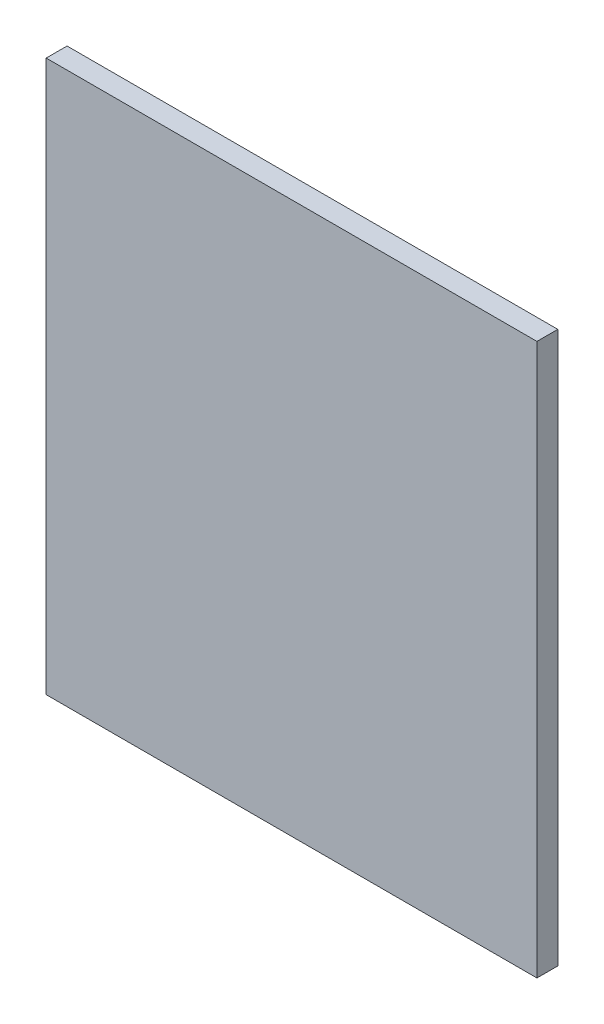
ISO-10303-21;
HEADER;
FILE_DESCRIPTION(('STEP AP214'),'2;1');
FILE_NAME('part.step','',(''),(''),'','','');
FILE_SCHEMA(('AUTOMOTIVE_DESIGN { 1 0 10303 214 1 1 1 1 }'));
ENDSEC;
DATA;
#1=APPLICATION_CONTEXT('core data for automotive mechanical design processes');
#2=APPLICATION_PROTOCOL_DEFINITION('international standard','automotive_design',2000,#1);
#3=PRODUCT_CONTEXT('',#1,'mechanical');
#4=PRODUCT('Part','Part','',(#3));
#5=PRODUCT_RELATED_PRODUCT_CATEGORY('part','',(#4));
#6=PRODUCT_DEFINITION_FORMATION('','',#4);
#7=PRODUCT_DEFINITION_CONTEXT('part definition',#1,'design');
#8=PRODUCT_DEFINITION('design','',#6,#7);
#9=PRODUCT_DEFINITION_SHAPE('','',#8);
#10=(LENGTH_UNIT() NAMED_UNIT(*) SI_UNIT(.MILLI.,.METRE.));
#11=(NAMED_UNIT(*) PLANE_ANGLE_UNIT() SI_UNIT($,.RADIAN.));
#12=(NAMED_UNIT(*) SI_UNIT($,.STERADIAN.) SOLID_ANGLE_UNIT());
#13=UNCERTAINTY_MEASURE_WITH_UNIT(LENGTH_MEASURE(1.E-05),#10,'distance_accuracy_value','');
#14=(GEOMETRIC_REPRESENTATION_CONTEXT(3) GLOBAL_UNCERTAINTY_ASSIGNED_CONTEXT((#13)) GLOBAL_UNIT_ASSIGNED_CONTEXT((#10,
#11,#12)) REPRESENTATION_CONTEXT('',''));
#15=CARTESIAN_POINT('',(0.,0.,0.));
#16=DIRECTION('',(0.,0.,1.));
#17=DIRECTION('',(1.,0.,0.));
#18=AXIS2_PLACEMENT_3D('',#15,#16,#17);
#19=CARTESIAN_POINT('',(-1.17499892,-1.3199999,0.));
#20=DIRECTION('',(-1.,0.,0.));
#21=DIRECTION('',(0.,1.,0.));
#22=AXIS2_PLACEMENT_3D('',#19,#20,#21);
#23=PLANE('',#22);
#24=DIRECTION('',(0.,0.,1.));
#25=VECTOR('',#24,1.);
#26=CARTESIAN_POINT('',(-1.17499892,-1.3199999,0.));
#27=LINE('',#26,#25);
#28=CARTESIAN_POINT('',(-1.17499892,-1.3199999,0.));
#29=VERTEX_POINT('',#28);
#30=CARTESIAN_POINT('',(-1.17499892,-1.3199999,0.10000234));
#31=VERTEX_POINT('',#30);
#32=EDGE_CURVE('E11',#29,#31,#27,.T.);
#33=ORIENTED_EDGE('',*,*,#32,.T.);
#34=DIRECTION('',(0.,1.,0.));
#35=VECTOR('',#34,1.);
#36=CARTESIAN_POINT('',(-1.17499892,-1.3199999,0.10000234));
#37=LINE('',#36,#35);
#38=CARTESIAN_POINT('',(-1.17499892,1.3199999,0.10000234));
#39=VERTEX_POINT('',#38);
#40=EDGE_CURVE('E24',#31,#39,#37,.T.);
#41=ORIENTED_EDGE('',*,*,#40,.T.);
#42=DIRECTION('',(0.,0.,1.));
#43=VECTOR('',#42,1.);
#44=CARTESIAN_POINT('',(-1.17499892,1.3199999,0.));
#45=LINE('',#44,#43);
#46=CARTESIAN_POINT('',(-1.17499892,1.3199999,0.));
#47=VERTEX_POINT('',#46);
#48=EDGE_CURVE('E85',#47,#39,#45,.T.);
#49=ORIENTED_EDGE('',*,*,#48,.F.);
#50=DIRECTION('',(0.,1.,0.));
#51=VECTOR('',#50,1.);
#52=CARTESIAN_POINT('',(-1.17499892,-1.3199999,0.));
#53=LINE('',#52,#51);
#54=EDGE_CURVE('E83',#29,#47,#53,.T.);
#55=ORIENTED_EDGE('',*,*,#54,.F.);
#56=EDGE_LOOP('',(#33,#41,#49,#55));
#57=FACE_BOUND('',#56,.T.);
#58=ADVANCED_FACE('F17',(#57),#23,.T.);
#59=CARTESIAN_POINT('',(-1.17499892,1.3199999,0.));
#60=DIRECTION('',(0.,1.,0.));
#61=DIRECTION('',(1.,0.,0.));
#62=AXIS2_PLACEMENT_3D('',#59,#60,#61);
#63=PLANE('',#62);
#64=ORIENTED_EDGE('',*,*,#48,.T.);
#65=DIRECTION('',(1.,0.,0.));
#66=VECTOR('',#65,1.);
#67=CARTESIAN_POINT('',(-1.17499892,1.3199999,0.10000234));
#68=LINE('',#67,#66);
#69=CARTESIAN_POINT('',(1.17500146,1.3199999,0.10000234));
#70=VERTEX_POINT('',#69);
#71=EDGE_CURVE('E81',#39,#70,#68,.T.);
#72=ORIENTED_EDGE('',*,*,#71,.T.);
#73=DIRECTION('',(0.,0.,1.));
#74=VECTOR('',#73,1.);
#75=CARTESIAN_POINT('',(1.17500146,1.3199999,0.));
#76=LINE('',#75,#74);
#77=CARTESIAN_POINT('',(1.17500146,1.3199999,0.));
#78=VERTEX_POINT('',#77);
#79=EDGE_CURVE('E79',#78,#70,#76,.T.);
#80=ORIENTED_EDGE('',*,*,#79,.F.);
#81=DIRECTION('',(1.,0.,0.));
#82=VECTOR('',#81,1.);
#83=CARTESIAN_POINT('',(-1.17499892,1.3199999,0.));
#84=LINE('',#83,#82);
#85=EDGE_CURVE('E70',#47,#78,#84,.T.);
#86=ORIENTED_EDGE('',*,*,#85,.F.);
#87=EDGE_LOOP('',(#64,#72,#80,#86));
#88=FACE_BOUND('',#87,.T.);
#89=ADVANCED_FACE('F90',(#88),#63,.T.);
#90=CARTESIAN_POINT('',(1.17500146,1.3199999,0.));
#91=DIRECTION('',(1.,0.,0.));
#92=DIRECTION('',(0.,-1.,0.));
#93=AXIS2_PLACEMENT_3D('',#90,#91,#92);
#94=PLANE('',#93);
#95=ORIENTED_EDGE('',*,*,#79,.T.);
#96=DIRECTION('',(0.,-1.,0.));
#97=VECTOR('',#96,1.);
#98=CARTESIAN_POINT('',(1.17500146,1.3199999,0.10000234));
#99=LINE('',#98,#97);
#100=CARTESIAN_POINT('',(1.17500146,-1.3199999,0.10000234));
#101=VERTEX_POINT('',#100);
#102=EDGE_CURVE('E60',#70,#101,#99,.T.);
#103=ORIENTED_EDGE('',*,*,#102,.T.);
#104=DIRECTION('',(0.,0.,1.));
#105=VECTOR('',#104,1.);
#106=CARTESIAN_POINT('',(1.17500146,-1.3199999,0.));
#107=LINE('',#106,#105);
#108=CARTESIAN_POINT('',(1.17500146,-1.3199999,0.));
#109=VERTEX_POINT('',#108);
#110=EDGE_CURVE('E54',#109,#101,#107,.T.);
#111=ORIENTED_EDGE('',*,*,#110,.F.);
#112=DIRECTION('',(0.,-1.,0.));
#113=VECTOR('',#112,1.);
#114=CARTESIAN_POINT('',(1.17500146,1.3199999,0.));
#115=LINE('',#114,#113);
#116=EDGE_CURVE('E58',#78,#109,#115,.T.);
#117=ORIENTED_EDGE('',*,*,#116,.F.);
#118=EDGE_LOOP('',(#95,#103,#111,#117));
#119=FACE_BOUND('',#118,.T.);
#120=ADVANCED_FACE('F57',(#119),#94,.T.);
#121=CARTESIAN_POINT('',(1.17500146,-1.3199999,0.));
#122=DIRECTION('',(0.,-1.,0.));
#123=DIRECTION('',(-1.,0.,0.));
#124=AXIS2_PLACEMENT_3D('',#121,#122,#123);
#125=PLANE('',#124);
#126=ORIENTED_EDGE('',*,*,#110,.T.);
#127=DIRECTION('',(-1.,0.,0.));
#128=VECTOR('',#127,1.);
#129=CARTESIAN_POINT('',(1.17500146,-1.3199999,0.10000234));
#130=LINE('',#129,#128);
#131=EDGE_CURVE('E71',#101,#31,#130,.T.);
#132=ORIENTED_EDGE('',*,*,#131,.T.);
#133=ORIENTED_EDGE('',*,*,#32,.F.);
#134=DIRECTION('',(-1.,0.,0.));
#135=VECTOR('',#134,1.);
#136=CARTESIAN_POINT('',(1.17500146,-1.3199999,0.));
#137=LINE('',#136,#135);
#138=EDGE_CURVE('E68',#109,#29,#137,.T.);
#139=ORIENTED_EDGE('',*,*,#138,.F.);
#140=EDGE_LOOP('',(#126,#132,#133,#139));
#141=FACE_BOUND('',#140,.T.);
#142=ADVANCED_FACE('F73',(#141),#125,.T.);
#143=CARTESIAN_POINT('',(-1.17499892,-1.3199999,0.));
#144=DIRECTION('',(0.,0.,1.));
#145=DIRECTION('',(1.,0.,0.));
#146=AXIS2_PLACEMENT_3D('',#143,#144,#145);
#147=PLANE('',#146);
#148=ORIENTED_EDGE('',*,*,#54,.T.);
#149=ORIENTED_EDGE('',*,*,#85,.T.);
#150=ORIENTED_EDGE('',*,*,#116,.T.);
#151=ORIENTED_EDGE('',*,*,#138,.T.);
#152=EDGE_LOOP('',(#148,#149,#150,#151));
#153=FACE_BOUND('',#152,.T.);
#154=ADVANCED_FACE('F67',(#153),#147,.F.);
#155=CARTESIAN_POINT('',(-1.17499892,-1.3199999,0.10000234));
#156=DIRECTION('',(0.,0.,1.));
#157=DIRECTION('',(1.,0.,0.));
#158=AXIS2_PLACEMENT_3D('',#155,#156,#157);
#159=PLANE('',#158);
#160=ORIENTED_EDGE('',*,*,#131,.F.);
#161=ORIENTED_EDGE('',*,*,#102,.F.);
#162=ORIENTED_EDGE('',*,*,#71,.F.);
#163=ORIENTED_EDGE('',*,*,#40,.F.);
#164=EDGE_LOOP('',(#160,#161,#162,#163));
#165=FACE_BOUND('',#164,.T.);
#166=ADVANCED_FACE('F91',(#165),#159,.T.);
#167=CLOSED_SHELL('',(#58,#89,#120,#142,#154,#166));
#168=MANIFOLD_SOLID_BREP('B1',#167);
#169=ADVANCED_BREP_SHAPE_REPRESENTATION('',(#18,#168),#14);
#170=SHAPE_DEFINITION_REPRESENTATION(#9,#169);
ENDSEC;
END-ISO-10303-21;
